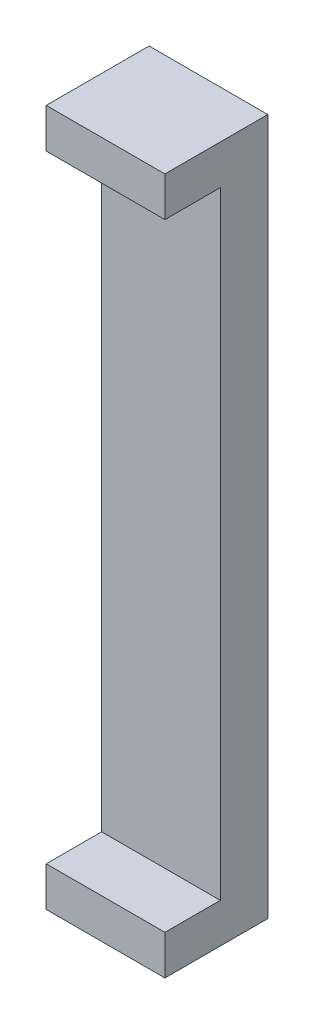
ISO-10303-21;
HEADER;
FILE_DESCRIPTION(('STEP AP214'),'2;1');
FILE_NAME('part.step','',(''),(''),'','','');
FILE_SCHEMA(('AUTOMOTIVE_DESIGN { 1 0 10303 214 1 1 1 1 }'));
ENDSEC;
DATA;
#1=APPLICATION_CONTEXT('core data for automotive mechanical design processes');
#2=APPLICATION_PROTOCOL_DEFINITION('international standard','automotive_design',2000,#1);
#3=PRODUCT_CONTEXT('',#1,'mechanical');
#4=PRODUCT('Part','Part','',(#3));
#5=PRODUCT_RELATED_PRODUCT_CATEGORY('part','',(#4));
#6=PRODUCT_DEFINITION_FORMATION('','',#4);
#7=PRODUCT_DEFINITION_CONTEXT('part definition',#1,'design');
#8=PRODUCT_DEFINITION('design','',#6,#7);
#9=PRODUCT_DEFINITION_SHAPE('','',#8);
#10=(LENGTH_UNIT() NAMED_UNIT(*) SI_UNIT(.MILLI.,.METRE.));
#11=(NAMED_UNIT(*) PLANE_ANGLE_UNIT() SI_UNIT($,.RADIAN.));
#12=(NAMED_UNIT(*) SI_UNIT($,.STERADIAN.) SOLID_ANGLE_UNIT());
#13=UNCERTAINTY_MEASURE_WITH_UNIT(LENGTH_MEASURE(1.E-05),#10,'distance_accuracy_value','');
#14=(GEOMETRIC_REPRESENTATION_CONTEXT(3) GLOBAL_UNCERTAINTY_ASSIGNED_CONTEXT((#13)) GLOBAL_UNIT_ASSIGNED_CONTEXT((#10,
#11,#12)) REPRESENTATION_CONTEXT('',''));
#15=CARTESIAN_POINT('',(0.,0.,0.));
#16=DIRECTION('',(0.,0.,1.));
#17=DIRECTION('',(1.,0.,0.));
#18=AXIS2_PLACEMENT_3D('',#15,#16,#17);
#19=CARTESIAN_POINT('',(0.,0.,3.));
#20=DIRECTION('',(0.,0.,-1.));
#21=DIRECTION('',(-1.,0.,0.));
#22=AXIS2_PLACEMENT_3D('',#19,#20,#21);
#23=PLANE('',#22);
#24=DIRECTION('',(1.,0.,0.));
#25=VECTOR('',#24,1.);
#26=CARTESIAN_POINT('',(0.,83.,3.));
#27=LINE('',#26,#25);
#28=CARTESIAN_POINT('',(-7.50000000000003,83.,3.));
#29=VERTEX_POINT('',#28);
#30=CARTESIAN_POINT('',(7.5,83.,3.));
#31=VERTEX_POINT('',#30);
#32=EDGE_CURVE('E54',#29,#31,#27,.T.);
#33=ORIENTED_EDGE('',*,*,#32,.F.);
#34=DIRECTION('',(0.,-1.,0.));
#35=VECTOR('',#34,1.);
#36=CARTESIAN_POINT('',(-7.5,0.,3.));
#37=LINE('',#36,#35);
#38=CARTESIAN_POINT('',(-7.5,5.,3.));
#39=VERTEX_POINT('',#38);
#40=EDGE_CURVE('E123',#29,#39,#37,.T.);
#41=ORIENTED_EDGE('',*,*,#40,.T.);
#42=DIRECTION('',(-1.,0.,0.));
#43=VECTOR('',#42,1.);
#44=CARTESIAN_POINT('',(0.,5.,3.));
#45=LINE('',#44,#43);
#46=CARTESIAN_POINT('',(7.5,5.,3.));
#47=VERTEX_POINT('',#46);
#48=EDGE_CURVE('E11',#47,#39,#45,.T.);
#49=ORIENTED_EDGE('',*,*,#48,.F.);
#50=DIRECTION('',(0.,1.,0.));
#51=VECTOR('',#50,1.);
#52=CARTESIAN_POINT('',(7.5,0.,3.));
#53=LINE('',#52,#51);
#54=EDGE_CURVE('E59',#47,#31,#53,.T.);
#55=ORIENTED_EDGE('',*,*,#54,.T.);
#56=EDGE_LOOP('',(#33,#41,#49,#55));
#57=FACE_BOUND('',#56,.T.);
#58=ADVANCED_FACE('F39',(#57),#23,.F.);
#59=CARTESIAN_POINT('',(-7.5,0.,3.));
#60=DIRECTION('',(1.,0.,0.));
#61=DIRECTION('',(0.,1.,0.));
#62=AXIS2_PLACEMENT_3D('',#59,#60,#61);
#63=PLANE('',#62);
#64=ORIENTED_EDGE('',*,*,#40,.F.);
#65=DIRECTION('',(0.,0.,-1.));
#66=VECTOR('',#65,1.);
#67=CARTESIAN_POINT('',(-7.50000000000003,83.,10.));
#68=LINE('',#67,#66);
#69=CARTESIAN_POINT('',(-7.50000000000003,83.,10.));
#70=VERTEX_POINT('',#69);
#71=EDGE_CURVE('E106',#70,#29,#68,.T.);
#72=ORIENTED_EDGE('',*,*,#71,.F.);
#73=DIRECTION('',(0.,-1.,0.));
#74=VECTOR('',#73,1.);
#75=CARTESIAN_POINT('',(-7.50000000000003,88.,10.));
#76=LINE('',#75,#74);
#77=CARTESIAN_POINT('',(-7.50000000000003,88.,10.));
#78=VERTEX_POINT('',#77);
#79=EDGE_CURVE('E113',#78,#70,#76,.T.);
#80=ORIENTED_EDGE('',*,*,#79,.F.);
#81=DIRECTION('',(0.,0.,-1.));
#82=VECTOR('',#81,1.);
#83=CARTESIAN_POINT('',(-7.50000000000003,88.,3.));
#84=LINE('',#83,#82);
#85=CARTESIAN_POINT('',(-7.50000000000003,88.,-3.));
#86=VERTEX_POINT('',#85);
#87=EDGE_CURVE('E148',#78,#86,#84,.T.);
#88=ORIENTED_EDGE('',*,*,#87,.T.);
#89=DIRECTION('',(0.,-1.,0.));
#90=VECTOR('',#89,1.);
#91=CARTESIAN_POINT('',(-7.5,0.,-3.));
#92=LINE('',#91,#90);
#93=CARTESIAN_POINT('',(-7.5,0.,-3.));
#94=VERTEX_POINT('',#93);
#95=EDGE_CURVE('E144',#86,#94,#92,.T.);
#96=ORIENTED_EDGE('',*,*,#95,.T.);
#97=DIRECTION('',(0.,0.,-1.));
#98=VECTOR('',#97,1.);
#99=CARTESIAN_POINT('',(-7.5,0.,3.));
#100=LINE('',#99,#98);
#101=CARTESIAN_POINT('',(-7.5,0.,10.));
#102=VERTEX_POINT('',#101);
#103=EDGE_CURVE('E47',#102,#94,#100,.T.);
#104=ORIENTED_EDGE('',*,*,#103,.F.);
#105=DIRECTION('',(0.,-1.,0.));
#106=VECTOR('',#105,1.);
#107=CARTESIAN_POINT('',(-7.5,0.,10.));
#108=LINE('',#107,#106);
#109=CARTESIAN_POINT('',(-7.5,5.,10.));
#110=VERTEX_POINT('',#109);
#111=EDGE_CURVE('E125',#110,#102,#108,.T.);
#112=ORIENTED_EDGE('',*,*,#111,.F.);
#113=DIRECTION('',(0.,0.,-1.));
#114=VECTOR('',#113,1.);
#115=CARTESIAN_POINT('',(-7.5,5.,10.));
#116=LINE('',#115,#114);
#117=EDGE_CURVE('E139',#110,#39,#116,.T.);
#118=ORIENTED_EDGE('',*,*,#117,.T.);
#119=EDGE_LOOP('',(#64,#72,#80,#88,#96,#104,#112,#118));
#120=FACE_BOUND('',#119,.T.);
#121=ADVANCED_FACE('F41',(#120),#63,.F.);
#122=CARTESIAN_POINT('',(-7.5,0.,3.));
#123=DIRECTION('',(0.,1.,0.));
#124=DIRECTION('',(-1.,0.,0.));
#125=AXIS2_PLACEMENT_3D('',#122,#123,#124);
#126=PLANE('',#125);
#127=DIRECTION('',(1.,0.,0.));
#128=VECTOR('',#127,1.);
#129=CARTESIAN_POINT('',(-7.5,0.,-3.));
#130=LINE('',#129,#128);
#131=CARTESIAN_POINT('',(7.5,0.,-3.));
#132=VERTEX_POINT('',#131);
#133=EDGE_CURVE('E151',#94,#132,#130,.T.);
#134=ORIENTED_EDGE('',*,*,#133,.T.);
#135=DIRECTION('',(0.,0.,-1.));
#136=VECTOR('',#135,1.);
#137=CARTESIAN_POINT('',(7.5,0.,3.));
#138=LINE('',#137,#136);
#139=CARTESIAN_POINT('',(7.5,0.,10.));
#140=VERTEX_POINT('',#139);
#141=EDGE_CURVE('E162',#140,#132,#138,.T.);
#142=ORIENTED_EDGE('',*,*,#141,.F.);
#143=DIRECTION('',(1.,0.,0.));
#144=VECTOR('',#143,1.);
#145=CARTESIAN_POINT('',(-7.5,0.,10.));
#146=LINE('',#145,#144);
#147=EDGE_CURVE('E132',#102,#140,#146,.T.);
#148=ORIENTED_EDGE('',*,*,#147,.F.);
#149=ORIENTED_EDGE('',*,*,#103,.T.);
#150=EDGE_LOOP('',(#134,#142,#148,#149));
#151=FACE_BOUND('',#150,.T.);
#152=ADVANCED_FACE('F166',(#151),#126,.F.);
#153=CARTESIAN_POINT('',(7.5,0.,3.));
#154=DIRECTION('',(-1.,0.,0.));
#155=DIRECTION('',(0.,0.,1.));
#156=AXIS2_PLACEMENT_3D('',#153,#154,#155);
#157=PLANE('',#156);
#158=DIRECTION('',(0.,0.,-1.));
#159=VECTOR('',#158,1.);
#160=CARTESIAN_POINT('',(7.5,88.,3.));
#161=LINE('',#160,#159);
#162=CARTESIAN_POINT('',(7.5,88.,10.));
#163=VERTEX_POINT('',#162);
#164=CARTESIAN_POINT('',(7.5,88.,-3.));
#165=VERTEX_POINT('',#164);
#166=EDGE_CURVE('E160',#163,#165,#161,.T.);
#167=ORIENTED_EDGE('',*,*,#166,.F.);
#168=DIRECTION('',(0.,1.,0.));
#169=VECTOR('',#168,1.);
#170=CARTESIAN_POINT('',(7.5,88.,10.));
#171=LINE('',#170,#169);
#172=CARTESIAN_POINT('',(7.5,83.,10.));
#173=VERTEX_POINT('',#172);
#174=EDGE_CURVE('E112',#173,#163,#171,.T.);
#175=ORIENTED_EDGE('',*,*,#174,.F.);
#176=DIRECTION('',(0.,0.,-1.));
#177=VECTOR('',#176,1.);
#178=CARTESIAN_POINT('',(7.5,83.,10.));
#179=LINE('',#178,#177);
#180=EDGE_CURVE('E108',#173,#31,#179,.T.);
#181=ORIENTED_EDGE('',*,*,#180,.T.);
#182=ORIENTED_EDGE('',*,*,#54,.F.);
#183=DIRECTION('',(0.,0.,-1.));
#184=VECTOR('',#183,1.);
#185=CARTESIAN_POINT('',(7.5,5.,10.));
#186=LINE('',#185,#184);
#187=CARTESIAN_POINT('',(7.5,5.,10.));
#188=VERTEX_POINT('',#187);
#189=EDGE_CURVE('E141',#188,#47,#186,.T.);
#190=ORIENTED_EDGE('',*,*,#189,.F.);
#191=DIRECTION('',(0.,1.,0.));
#192=VECTOR('',#191,1.);
#193=CARTESIAN_POINT('',(7.5,0.,10.));
#194=LINE('',#193,#192);
#195=EDGE_CURVE('E135',#140,#188,#194,.T.);
#196=ORIENTED_EDGE('',*,*,#195,.F.);
#197=ORIENTED_EDGE('',*,*,#141,.T.);
#198=DIRECTION('',(0.,1.,0.));
#199=VECTOR('',#198,1.);
#200=CARTESIAN_POINT('',(7.5,0.,-3.));
#201=LINE('',#200,#199);
#202=EDGE_CURVE('E154',#132,#165,#201,.T.);
#203=ORIENTED_EDGE('',*,*,#202,.T.);
#204=EDGE_LOOP('',(#167,#175,#181,#182,#190,#196,#197,#203));
#205=FACE_BOUND('',#204,.T.);
#206=ADVANCED_FACE('F176',(#205),#157,.F.);
#207=CARTESIAN_POINT('',(-7.50000000000003,88.,3.));
#208=DIRECTION('',(0.,-1.,0.));
#209=DIRECTION('',(0.,0.,-1.));
#210=AXIS2_PLACEMENT_3D('',#207,#208,#209);
#211=PLANE('',#210);
#212=ORIENTED_EDGE('',*,*,#166,.T.);
#213=DIRECTION('',(-1.,0.,0.));
#214=VECTOR('',#213,1.);
#215=CARTESIAN_POINT('',(-7.50000000000003,88.,-3.));
#216=LINE('',#215,#214);
#217=EDGE_CURVE('E146',#165,#86,#216,.T.);
#218=ORIENTED_EDGE('',*,*,#217,.T.);
#219=ORIENTED_EDGE('',*,*,#87,.F.);
#220=DIRECTION('',(-1.,0.,0.));
#221=VECTOR('',#220,1.);
#222=CARTESIAN_POINT('',(-7.50000000000003,88.,10.));
#223=LINE('',#222,#221);
#224=EDGE_CURVE('E119',#163,#78,#223,.T.);
#225=ORIENTED_EDGE('',*,*,#224,.F.);
#226=EDGE_LOOP('',(#212,#218,#219,#225));
#227=FACE_BOUND('',#226,.T.);
#228=ADVANCED_FACE('F174',(#227),#211,.F.);
#229=CARTESIAN_POINT('',(0.,0.,-3.));
#230=DIRECTION('',(0.,0.,-1.));
#231=DIRECTION('',(-1.,0.,0.));
#232=AXIS2_PLACEMENT_3D('',#229,#230,#231);
#233=PLANE('',#232);
#234=ORIENTED_EDGE('',*,*,#95,.F.);
#235=ORIENTED_EDGE('',*,*,#217,.F.);
#236=ORIENTED_EDGE('',*,*,#202,.F.);
#237=ORIENTED_EDGE('',*,*,#133,.F.);
#238=EDGE_LOOP('',(#234,#235,#236,#237));
#239=FACE_BOUND('',#238,.T.);
#240=ADVANCED_FACE('F171',(#239),#233,.T.);
#241=CARTESIAN_POINT('',(-7.5,5.,10.));
#242=DIRECTION('',(0.,-1.,0.));
#243=DIRECTION('',(0.,0.,-1.));
#244=AXIS2_PLACEMENT_3D('',#241,#242,#243);
#245=PLANE('',#244);
#246=ORIENTED_EDGE('',*,*,#189,.T.);
#247=ORIENTED_EDGE('',*,*,#48,.T.);
#248=ORIENTED_EDGE('',*,*,#117,.F.);
#249=DIRECTION('',(-1.,0.,0.));
#250=VECTOR('',#249,1.);
#251=CARTESIAN_POINT('',(-7.5,5.,10.));
#252=LINE('',#251,#250);
#253=EDGE_CURVE('E137',#188,#110,#252,.T.);
#254=ORIENTED_EDGE('',*,*,#253,.F.);
#255=EDGE_LOOP('',(#246,#247,#248,#254));
#256=FACE_BOUND('',#255,.T.);
#257=ADVANCED_FACE('F184',(#256),#245,.F.);
#258=CARTESIAN_POINT('',(0.,0.,10.));
#259=DIRECTION('',(0.,0.,-1.));
#260=DIRECTION('',(-1.,0.,0.));
#261=AXIS2_PLACEMENT_3D('',#258,#259,#260);
#262=PLANE('',#261);
#263=ORIENTED_EDGE('',*,*,#111,.T.);
#264=ORIENTED_EDGE('',*,*,#147,.T.);
#265=ORIENTED_EDGE('',*,*,#195,.T.);
#266=ORIENTED_EDGE('',*,*,#253,.T.);
#267=EDGE_LOOP('',(#263,#264,#265,#266));
#268=FACE_BOUND('',#267,.T.);
#269=ADVANCED_FACE('F180',(#268),#262,.F.);
#270=CARTESIAN_POINT('',(-7.50000000000003,83.,10.));
#271=DIRECTION('',(0.,1.,0.));
#272=DIRECTION('',(0.,0.,1.));
#273=AXIS2_PLACEMENT_3D('',#270,#271,#272);
#274=PLANE('',#273);
#275=ORIENTED_EDGE('',*,*,#71,.T.);
#276=ORIENTED_EDGE('',*,*,#32,.T.);
#277=ORIENTED_EDGE('',*,*,#180,.F.);
#278=DIRECTION('',(1.,0.,0.));
#279=VECTOR('',#278,1.);
#280=CARTESIAN_POINT('',(-7.50000000000003,83.,10.));
#281=LINE('',#280,#279);
#282=EDGE_CURVE('E102',#70,#173,#281,.T.);
#283=ORIENTED_EDGE('',*,*,#282,.F.);
#284=EDGE_LOOP('',(#275,#276,#277,#283));
#285=FACE_BOUND('',#284,.T.);
#286=ADVANCED_FACE('F104',(#285),#274,.F.);
#287=CARTESIAN_POINT('',(0.,0.,10.));
#288=DIRECTION('',(0.,0.,1.));
#289=DIRECTION('',(1.,0.,0.));
#290=AXIS2_PLACEMENT_3D('',#287,#288,#289);
#291=PLANE('',#290);
#292=ORIENTED_EDGE('',*,*,#79,.T.);
#293=ORIENTED_EDGE('',*,*,#282,.T.);
#294=ORIENTED_EDGE('',*,*,#174,.T.);
#295=ORIENTED_EDGE('',*,*,#224,.T.);
#296=EDGE_LOOP('',(#292,#293,#294,#295));
#297=FACE_BOUND('',#296,.T.);
#298=ADVANCED_FACE('F117',(#297),#291,.T.);
#299=CLOSED_SHELL('',(#58,#121,#152,#206,#228,#240,#257,#269,#286,#298));
#300=MANIFOLD_SOLID_BREP('B2',#299);
#301=ADVANCED_BREP_SHAPE_REPRESENTATION('',(#18,#300),#14);
#302=SHAPE_DEFINITION_REPRESENTATION(#9,#301);
ENDSEC;
END-ISO-10303-21;
